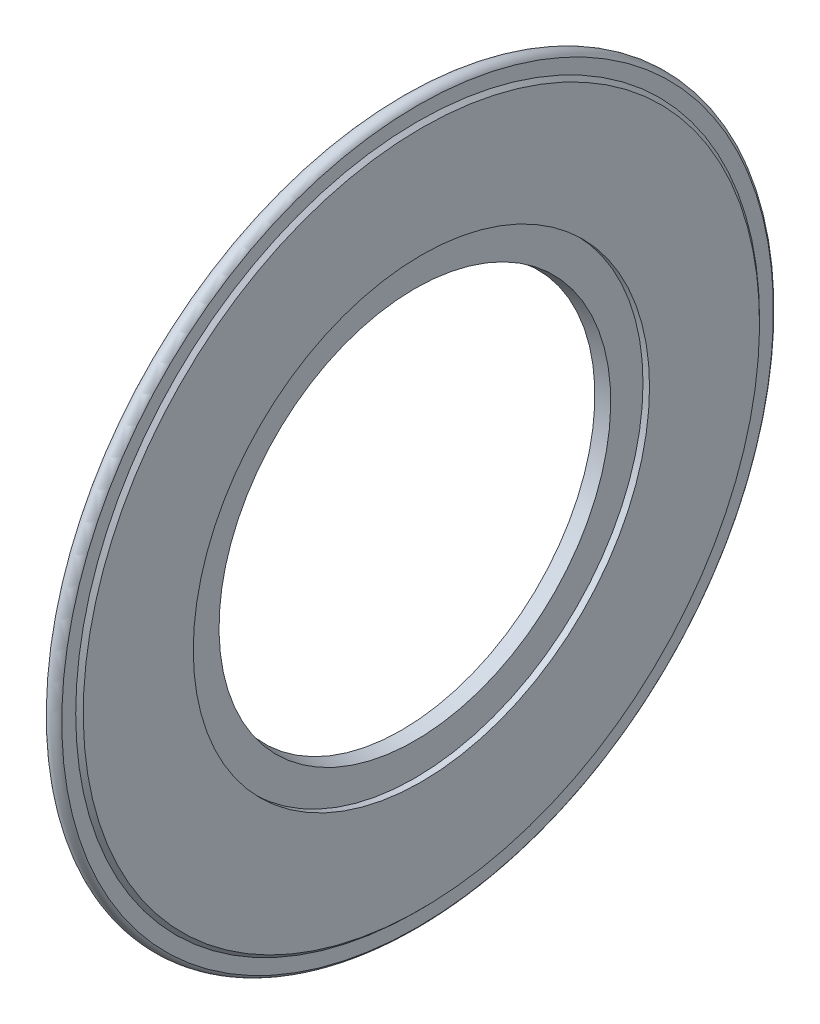
ISO-10303-21;
HEADER;
FILE_DESCRIPTION(('STEP AP214'),'2;1');
FILE_NAME('part.step','',(''),(''),'','','');
FILE_SCHEMA(('AUTOMOTIVE_DESIGN { 1 0 10303 214 1 1 1 1 }'));
ENDSEC;
DATA;
#1=APPLICATION_CONTEXT('core data for automotive mechanical design processes');
#2=APPLICATION_PROTOCOL_DEFINITION('international standard','automotive_design',2000,#1);
#3=PRODUCT_CONTEXT('',#1,'mechanical');
#4=PRODUCT('Part','Part','',(#3));
#5=PRODUCT_RELATED_PRODUCT_CATEGORY('part','',(#4));
#6=PRODUCT_DEFINITION_FORMATION('','',#4);
#7=PRODUCT_DEFINITION_CONTEXT('part definition',#1,'design');
#8=PRODUCT_DEFINITION('design','',#6,#7);
#9=PRODUCT_DEFINITION_SHAPE('','',#8);
#10=(LENGTH_UNIT() NAMED_UNIT(*) SI_UNIT(.MILLI.,.METRE.));
#11=(NAMED_UNIT(*) PLANE_ANGLE_UNIT() SI_UNIT($,.RADIAN.));
#12=(NAMED_UNIT(*) SI_UNIT($,.STERADIAN.) SOLID_ANGLE_UNIT());
#13=UNCERTAINTY_MEASURE_WITH_UNIT(LENGTH_MEASURE(1.E-05),#10,'distance_accuracy_value','');
#14=(GEOMETRIC_REPRESENTATION_CONTEXT(3) GLOBAL_UNCERTAINTY_ASSIGNED_CONTEXT((#13)) GLOBAL_UNIT_ASSIGNED_CONTEXT((#10,
#11,#12)) REPRESENTATION_CONTEXT('',''));
#15=CARTESIAN_POINT('',(0.,0.,0.));
#16=DIRECTION('',(0.,0.,1.));
#17=DIRECTION('',(1.,0.,0.));
#18=AXIS2_PLACEMENT_3D('',#15,#16,#17);
#19=CARTESIAN_POINT('',(7.517,0.,0.));
#20=DIRECTION('',(1.,0.,0.));
#21=DIRECTION('',(0.,1.,0.));
#22=AXIS2_PLACEMENT_3D('',#19,#20,#21);
#23=CONICAL_SURFACE('',#22,6.264641465067,0.17453292519943);
#24=CARTESIAN_POINT('',(7.3,0.,0.));
#25=DIRECTION('',(-1.,0.,0.));
#26=DIRECTION('',(0.,1.,0.));
#27=AXIS2_PLACEMENT_3D('',#24,#25,#26);
#28=CIRCLE('',#27,6.22637851025326);
#29=CARTESIAN_POINT('',(7.3,6.22637851025326,0.));
#30=VERTEX_POINT('',#29);
#31=EDGE_CURVE('E11',#30,#30,#28,.T.);
#32=ORIENTED_EDGE('',*,*,#31,.T.);
#33=EDGE_LOOP('',(#32));
#34=FACE_BOUND('',#33,.T.);
#35=CARTESIAN_POINT('',(7.734,0.,0.));
#36=DIRECTION('',(-1.,0.,0.));
#37=DIRECTION('',(0.,1.,0.));
#38=AXIS2_PLACEMENT_3D('',#35,#36,#37);
#39=CIRCLE('',#38,6.30290441988073);
#40=CARTESIAN_POINT('',(7.734,6.30290441988073,0.));
#41=VERTEX_POINT('',#40);
#42=EDGE_CURVE('E85',#41,#41,#39,.T.);
#43=ORIENTED_EDGE('',*,*,#42,.F.);
#44=EDGE_LOOP('',(#43));
#45=FACE_BOUND('',#44,.T.);
#46=ADVANCED_FACE('F16',(#34,#45),#23,.F.);
#47=CARTESIAN_POINT('',(7.20166495642233,0.,0.));
#48=DIRECTION('',(-1.,0.,0.));
#49=DIRECTION('',(0.,1.,0.));
#50=AXIS2_PLACEMENT_3D('',#47,#48,#49);
#51=CONICAL_SURFACE('',#50,6.78406425512663,1.39626340159546);
#52=CARTESIAN_POINT('',(7.10332991284465,0.,0.));
#53=DIRECTION('',(-1.,0.,0.));
#54=DIRECTION('',(0.,1.,0.));
#55=AXIS2_PLACEMENT_3D('',#52,#53,#54);
#56=CIRCLE('',#55,7.34175);
#57=CARTESIAN_POINT('',(7.10332991284465,7.34175,0.));
#58=VERTEX_POINT('',#57);
#59=EDGE_CURVE('E20',#58,#58,#56,.T.);
#60=ORIENTED_EDGE('',*,*,#59,.T.);
#61=EDGE_LOOP('',(#60));
#62=FACE_BOUND('',#61,.T.);
#63=ORIENTED_EDGE('',*,*,#31,.F.);
#64=EDGE_LOOP('',(#63));
#65=FACE_BOUND('',#64,.T.);
#66=ADVANCED_FACE('F117',(#62,#65),#51,.F.);
#67=CARTESIAN_POINT('',(6.99166495642233,0.,0.));
#68=DIRECTION('',(1.,0.,0.));
#69=DIRECTION('',(0.,1.,0.));
#70=AXIS2_PLACEMENT_3D('',#67,#68,#69);
#71=CYLINDRICAL_SURFACE('',#70,7.34175);
#72=CARTESIAN_POINT('',(6.88,0.,0.));
#73=DIRECTION('',(-1.,0.,0.));
#74=DIRECTION('',(0.,1.,0.));
#75=AXIS2_PLACEMENT_3D('',#72,#73,#74);
#76=CIRCLE('',#75,7.34175);
#77=CARTESIAN_POINT('',(6.88,7.34175,0.));
#78=VERTEX_POINT('',#77);
#79=EDGE_CURVE('E73',#78,#78,#76,.T.);
#80=ORIENTED_EDGE('',*,*,#79,.T.);
#81=EDGE_LOOP('',(#80));
#82=FACE_BOUND('',#81,.T.);
#83=ORIENTED_EDGE('',*,*,#59,.F.);
#84=EDGE_LOOP('',(#83));
#85=FACE_BOUND('',#84,.T.);
#86=ADVANCED_FACE('F74',(#82,#85),#71,.F.);
#87=CARTESIAN_POINT('',(7.202,0.,0.));
#88=DIRECTION('',(1.,0.,0.));
#89=DIRECTION('',(0.,1.,0.));
#90=AXIS2_PLACEMENT_3D('',#87,#88,#89);
#91=CONICAL_SURFACE('',#90,7.66375,0.785398163397448);
#92=CARTESIAN_POINT('',(7.524,0.,0.));
#93=DIRECTION('',(-1.,0.,0.));
#94=DIRECTION('',(0.,1.,0.));
#95=AXIS2_PLACEMENT_3D('',#92,#93,#94);
#96=CIRCLE('',#95,7.98575);
#97=CARTESIAN_POINT('',(7.524,7.98575,0.));
#98=VERTEX_POINT('',#97);
#99=EDGE_CURVE('E69',#98,#98,#96,.T.);
#100=ORIENTED_EDGE('',*,*,#99,.T.);
#101=EDGE_LOOP('',(#100));
#102=FACE_BOUND('',#101,.T.);
#103=ORIENTED_EDGE('',*,*,#79,.F.);
#104=EDGE_LOOP('',(#103));
#105=FACE_BOUND('',#104,.T.);
#106=ADVANCED_FACE('F125',(#102,#105),#91,.T.);
#107=CARTESIAN_POINT('',(7.524,9.3254575,0.));
#108=DIRECTION('',(-1.,0.,0.));
#109=DIRECTION('',(0.,1.,0.));
#110=AXIS2_PLACEMENT_3D('',#107,#108,#109);
#111=PLANE('',#110);
#112=CARTESIAN_POINT('',(7.524,0.,0.));
#113=DIRECTION('',(-1.,0.,0.));
#114=DIRECTION('',(0.,1.,0.));
#115=AXIS2_PLACEMENT_3D('',#112,#113,#114);
#116=CIRCLE('',#115,10.665165);
#117=CARTESIAN_POINT('',(7.524,10.665165,0.));
#118=VERTEX_POINT('',#117);
#119=EDGE_CURVE('E78',#118,#118,#116,.T.);
#120=ORIENTED_EDGE('',*,*,#119,.T.);
#121=EDGE_LOOP('',(#120));
#122=FACE_BOUND('',#121,.T.);
#123=ORIENTED_EDGE('',*,*,#99,.F.);
#124=EDGE_LOOP('',(#123));
#125=FACE_BOUND('',#124,.T.);
#126=ADVANCED_FACE('F127',(#122,#125),#111,.T.);
#127=CARTESIAN_POINT('',(7.35287475749596,0.,0.));
#128=DIRECTION('',(1.,0.,0.));
#129=DIRECTION('',(0.,1.,0.));
#130=AXIS2_PLACEMENT_3D('',#127,#128,#129);
#131=CYLINDRICAL_SURFACE('',#130,10.665165);
#132=CARTESIAN_POINT('',(7.18174951499193,0.,0.));
#133=DIRECTION('',(-1.,0.,0.));
#134=DIRECTION('',(0.,1.,0.));
#135=AXIS2_PLACEMENT_3D('',#132,#133,#134);
#136=CIRCLE('',#135,10.665165);
#137=CARTESIAN_POINT('',(7.18174951499193,10.665165,0.));
#138=VERTEX_POINT('',#137);
#139=EDGE_CURVE('E52',#138,#138,#136,.T.);
#140=ORIENTED_EDGE('',*,*,#139,.T.);
#141=EDGE_LOOP('',(#140));
#142=FACE_BOUND('',#141,.T.);
#143=ORIENTED_EDGE('',*,*,#119,.F.);
#144=EDGE_LOOP('',(#143));
#145=FACE_BOUND('',#144,.T.);
#146=ADVANCED_FACE('F18',(#142,#145),#131,.F.);
#147=CARTESIAN_POINT('',(7.24300167207425,0.,0.));
#148=DIRECTION('',(1.,0.,0.));
#149=DIRECTION('',(0.,1.,0.));
#150=AXIS2_PLACEMENT_3D('',#147,#148,#149);
#151=CONICAL_SURFACE('',#150,11.0125432448734,1.39626340159546);
#152=CARTESIAN_POINT('',(7.30425382915658,0.,0.));
#153=DIRECTION('',(-1.,0.,0.));
#154=DIRECTION('',(0.,1.,0.));
#155=AXIS2_PLACEMENT_3D('',#152,#153,#154);
#156=CIRCLE('',#155,11.3599214897467);
#157=CARTESIAN_POINT('',(7.30425382915658,11.3599214897467,0.));
#158=VERTEX_POINT('',#157);
#159=EDGE_CURVE('E59',#158,#158,#156,.T.);
#160=ORIENTED_EDGE('',*,*,#159,.T.);
#161=EDGE_LOOP('',(#160));
#162=FACE_BOUND('',#161,.T.);
#163=ORIENTED_EDGE('',*,*,#139,.F.);
#164=EDGE_LOOP('',(#163));
#165=FACE_BOUND('',#164,.T.);
#166=ADVANCED_FACE('F133',(#162,#165),#151,.T.);
#167=CARTESIAN_POINT('',(7.58,0.,0.));
#168=DIRECTION('',(-1.,0.,0.));
#169=DIRECTION('',(0.,0.,1.));
#170=AXIS2_PLACEMENT_3D('',#167,#168,#169);
#171=TOROIDAL_SURFACE('',#170,11.3113,0.28);
#172=CARTESIAN_POINT('',(7.82248711305964,0.,0.));
#173=DIRECTION('',(-1.,0.,0.));
#174=DIRECTION('',(0.,1.,0.));
#175=AXIS2_PLACEMENT_3D('',#172,#173,#174);
#176=CIRCLE('',#175,11.4513);
#177=CARTESIAN_POINT('',(7.82248711305964,11.4513,0.));
#178=VERTEX_POINT('',#177);
#179=EDGE_CURVE('E90',#178,#178,#176,.T.);
#180=ORIENTED_EDGE('',*,*,#179,.T.);
#181=EDGE_LOOP('',(#180));
#182=FACE_BOUND('',#181,.T.);
#183=ORIENTED_EDGE('',*,*,#159,.F.);
#184=EDGE_LOOP('',(#183));
#185=FACE_BOUND('',#184,.T.);
#186=ADVANCED_FACE('F113',(#182,#185),#171,.T.);
#187=CARTESIAN_POINT('',(7.82248711305964,11.2273,0.));
#188=DIRECTION('',(1.,0.,0.));
#189=DIRECTION('',(0.,-1.,0.));
#190=AXIS2_PLACEMENT_3D('',#187,#188,#189);
#191=PLANE('',#190);
#192=CARTESIAN_POINT('',(7.82248711305964,0.,0.));
#193=DIRECTION('',(-1.,0.,0.));
#194=DIRECTION('',(0.,1.,0.));
#195=AXIS2_PLACEMENT_3D('',#192,#193,#194);
#196=CIRCLE('',#195,11.0033);
#197=CARTESIAN_POINT('',(7.82248711305964,11.0033,0.));
#198=VERTEX_POINT('',#197);
#199=EDGE_CURVE('E82',#198,#198,#196,.T.);
#200=ORIENTED_EDGE('',*,*,#199,.T.);
#201=EDGE_LOOP('',(#200));
#202=FACE_BOUND('',#201,.T.);
#203=ORIENTED_EDGE('',*,*,#179,.F.);
#204=EDGE_LOOP('',(#203));
#205=FACE_BOUND('',#204,.T.);
#206=ADVANCED_FACE('F97',(#202,#205),#191,.T.);
#207=CARTESIAN_POINT('',(7.88324355652982,0.,0.));
#208=DIRECTION('',(-1.,0.,0.));
#209=DIRECTION('',(0.,1.,0.));
#210=AXIS2_PLACEMENT_3D('',#207,#208,#209);
#211=CONICAL_SURFACE('',#210,10.9425435565298,0.785398163397455);
#212=CARTESIAN_POINT('',(7.944,0.,0.));
#213=DIRECTION('',(-1.,0.,0.));
#214=DIRECTION('',(0.,1.,0.));
#215=AXIS2_PLACEMENT_3D('',#212,#213,#214);
#216=CIRCLE('',#215,10.8817871130596);
#217=CARTESIAN_POINT('',(7.944,10.8817871130596,0.));
#218=VERTEX_POINT('',#217);
#219=EDGE_CURVE('E86',#218,#218,#216,.T.);
#220=ORIENTED_EDGE('',*,*,#219,.T.);
#221=EDGE_LOOP('',(#220));
#222=FACE_BOUND('',#221,.T.);
#223=ORIENTED_EDGE('',*,*,#199,.F.);
#224=EDGE_LOOP('',(#223));
#225=FACE_BOUND('',#224,.T.);
#226=ADVANCED_FACE('F100',(#222,#225),#211,.T.);
#227=CARTESIAN_POINT('',(7.944,9.11176855652982,0.));
#228=DIRECTION('',(1.,0.,0.));
#229=DIRECTION('',(0.,-1.,0.));
#230=AXIS2_PLACEMENT_3D('',#227,#228,#229);
#231=PLANE('',#230);
#232=CARTESIAN_POINT('',(7.944,0.,0.));
#233=DIRECTION('',(-1.,0.,0.));
#234=DIRECTION('',(0.,1.,0.));
#235=AXIS2_PLACEMENT_3D('',#232,#233,#234);
#236=CIRCLE('',#235,7.34175);
#237=CARTESIAN_POINT('',(7.944,7.34175,0.));
#238=VERTEX_POINT('',#237);
#239=EDGE_CURVE('E88',#238,#238,#236,.T.);
#240=ORIENTED_EDGE('',*,*,#239,.T.);
#241=EDGE_LOOP('',(#240));
#242=FACE_BOUND('',#241,.T.);
#243=ORIENTED_EDGE('',*,*,#219,.F.);
#244=EDGE_LOOP('',(#243));
#245=FACE_BOUND('',#244,.T.);
#246=ADVANCED_FACE('F102',(#242,#245),#231,.T.);
#247=CARTESIAN_POINT('',(7.839,0.,0.));
#248=DIRECTION('',(1.,0.,0.));
#249=DIRECTION('',(0.,1.,0.));
#250=AXIS2_PLACEMENT_3D('',#247,#248,#249);
#251=CYLINDRICAL_SURFACE('',#250,7.34175);
#252=CARTESIAN_POINT('',(7.734,0.,0.));
#253=DIRECTION('',(-1.,0.,0.));
#254=DIRECTION('',(0.,1.,0.));
#255=AXIS2_PLACEMENT_3D('',#252,#253,#254);
#256=CIRCLE('',#255,7.34175);
#257=CARTESIAN_POINT('',(7.734,7.34175,0.));
#258=VERTEX_POINT('',#257);
#259=EDGE_CURVE('E83',#258,#258,#256,.T.);
#260=ORIENTED_EDGE('',*,*,#259,.T.);
#261=EDGE_LOOP('',(#260));
#262=FACE_BOUND('',#261,.T.);
#263=ORIENTED_EDGE('',*,*,#239,.F.);
#264=EDGE_LOOP('',(#263));
#265=FACE_BOUND('',#264,.T.);
#266=ADVANCED_FACE('F110',(#262,#265),#251,.F.);
#267=CARTESIAN_POINT('',(7.734,6.82232720994037,0.));
#268=DIRECTION('',(1.,0.,0.));
#269=DIRECTION('',(0.,-1.,0.));
#270=AXIS2_PLACEMENT_3D('',#267,#268,#269);
#271=PLANE('',#270);
#272=ORIENTED_EDGE('',*,*,#42,.T.);
#273=EDGE_LOOP('',(#272));
#274=FACE_BOUND('',#273,.T.);
#275=ORIENTED_EDGE('',*,*,#259,.F.);
#276=EDGE_LOOP('',(#275));
#277=FACE_BOUND('',#276,.T.);
#278=ADVANCED_FACE('F129',(#274,#277),#271,.T.);
#279=CLOSED_SHELL('',(#46,#66,#86,#106,#126,#146,#166,#186,#206,#226,#246,#266,#278));
#280=MANIFOLD_SOLID_BREP('B1',#279);
#281=ADVANCED_BREP_SHAPE_REPRESENTATION('',(#18,#280),#14);
#282=SHAPE_DEFINITION_REPRESENTATION(#9,#281);
ENDSEC;
END-ISO-10303-21;
